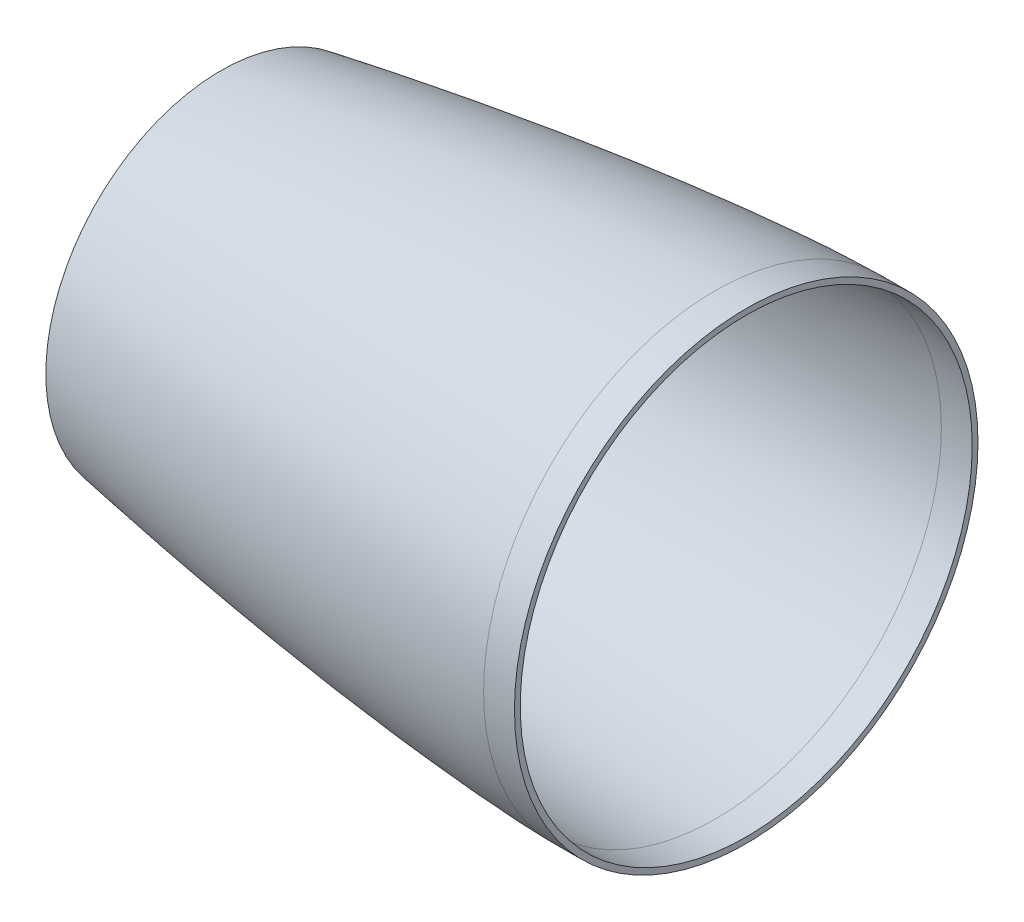
ISO-10303-21;
HEADER;
FILE_DESCRIPTION(('STEP AP214'),'2;1');
FILE_NAME('part.step','',(''),(''),'','','');
FILE_SCHEMA(('AUTOMOTIVE_DESIGN { 1 0 10303 214 1 1 1 1 }'));
ENDSEC;
DATA;
#1=APPLICATION_CONTEXT('core data for automotive mechanical design processes');
#2=APPLICATION_PROTOCOL_DEFINITION('international standard','automotive_design',2000,#1);
#3=PRODUCT_CONTEXT('',#1,'mechanical');
#4=PRODUCT('Part','Part','',(#3));
#5=PRODUCT_RELATED_PRODUCT_CATEGORY('part','',(#4));
#6=PRODUCT_DEFINITION_FORMATION('','',#4);
#7=PRODUCT_DEFINITION_CONTEXT('part definition',#1,'design');
#8=PRODUCT_DEFINITION('design','',#6,#7);
#9=PRODUCT_DEFINITION_SHAPE('','',#8);
#10=(LENGTH_UNIT() NAMED_UNIT(*) SI_UNIT(.MILLI.,.METRE.));
#11=(NAMED_UNIT(*) PLANE_ANGLE_UNIT() SI_UNIT($,.RADIAN.));
#12=(NAMED_UNIT(*) SI_UNIT($,.STERADIAN.) SOLID_ANGLE_UNIT());
#13=UNCERTAINTY_MEASURE_WITH_UNIT(LENGTH_MEASURE(1.E-05),#10,'distance_accuracy_value','');
#14=(GEOMETRIC_REPRESENTATION_CONTEXT(3) GLOBAL_UNCERTAINTY_ASSIGNED_CONTEXT((#13)) GLOBAL_UNIT_ASSIGNED_CONTEXT((#10,
#11,#12)) REPRESENTATION_CONTEXT('',''));
#15=CARTESIAN_POINT('',(0.,0.,0.));
#16=DIRECTION('',(0.,0.,1.));
#17=DIRECTION('',(1.,0.,0.));
#18=AXIS2_PLACEMENT_3D('',#15,#16,#17);
#19=CARTESIAN_POINT('',(457.2,95.2499999863099,0.));
#20=CARTESIAN_POINT('',(455.973700484007,95.2442558489218,0.));
#21=CARTESIAN_POINT('',(453.521410507465,95.2001609293709,0.));
#22=CARTESIAN_POINT('',(448.618051981354,95.0620461285506,0.));
#23=CARTESIAN_POINT('',(440.032338734873,94.6975648763611,0.));
#24=CARTESIAN_POINT('',(428.99507734638,94.0675681603095,0.));
#25=CARTESIAN_POINT('',(411.834102605625,92.8373554040269,0.));
#26=CARTESIAN_POINT('',(389.792768776019,90.8705573506526,0.));
#27=CARTESIAN_POINT('',(364.121565724609,88.1293712554599,0.));
#28=CARTESIAN_POINT('',(334.84304941187,84.4812168471433,0.));
#29=CARTESIAN_POINT('',(305.625866718072,80.3721875169129,0.));
#30=CARTESIAN_POINT('',(276.472706829773,75.8317963448619,0.));
#31=CARTESIAN_POINT('',(247.387631707993,70.8740216213803,0.));
#32=CARTESIAN_POINT('',(218.376688060461,65.4994445148525,0.));
#33=CARTESIAN_POINT('',(189.448153440764,59.6968671983802,0.));
#34=CARTESIAN_POINT('',(160.614305525022,53.4402971568738,0.));
#35=CARTESIAN_POINT('',(131.892371679484,46.686426531904,0.));
#36=CARTESIAN_POINT('',(103.310212009362,39.3619752554907,0.));
#37=CARTESIAN_POINT('',(75.6130579703372,31.5462124058929,0.));
#38=CARTESIAN_POINT('',(51.6882713202313,23.9818909923328,0.));
#39=CARTESIAN_POINT('',(32.6155540991965,17.1304800128776,0.));
#40=CARTESIAN_POINT('',(19.2936045724269,11.6017464036061,0.));
#41=CARTESIAN_POINT('',(11.4561201377879,7.87661771037368,0.));
#42=CARTESIAN_POINT('',(6.61398983203532,5.22529479758573,0.));
#43=CARTESIAN_POINT('',(3.82527199485086,3.46661844296927,0.));
#44=CARTESIAN_POINT('',(2.23811863344633,2.31922525620693,0.));
#45=CARTESIAN_POINT('',(1.3250808545305,1.56516933155385,0.));
#46=CARTESIAN_POINT('',(0.802086139992584,1.07329374189902,0.));
#47=CARTESIAN_POINT('',(0.508304998244186,0.760811711281794,0.));
#48=CARTESIAN_POINT('',(0.336037993223269,0.556544125855294,0.));
#49=CARTESIAN_POINT('',(0.220401302941073,0.406590083529717,0.));
#50=CARTESIAN_POINT('',(0.135390601814985,0.284235784515475,0.));
#51=CARTESIAN_POINT('',(0.0705930880732007,0.176725306763241,0.));
#52=CARTESIAN_POINT('',(0.0261974766976189,0.0850108023905772,0.));
#53=CARTESIAN_POINT('',(0.00822914946549372,0.0372713204893021,0.));
#54=CARTESIAN_POINT('',(0.0022614130657891,0.0125596339287031,0.));
#55=CARTESIAN_POINT('',(0.,0.,0.));
#56=B_SPLINE_CURVE_WITH_KNOTS('',4,(#19,#20,#21,#22,#23,#24,#25,#26,#27,#28,#29,#30,#31,#32,#33,
#34,#35,#36,#37,#38,#39,#40,#41,#42,#43,#44,#45,#46,#47,#48,#49,#50,#51,#52,#53,#54,#55),
.UNSPECIFIED.,.F.,.F.,(5,1,1,1,1,1,1,1,1,1,1,1,1,1,1,1,1,1,1,1,1,1,1,1,1,1,1,1,1,1,1,1,1,5),(0.,
0.010433363720785,0.0208667274415699,0.04173345488314,0.0731105437816442,0.104487632680148,
0.167241811319938,0.229995988937202,0.292750168797301,0.355504348198085,0.418258525795471,
0.481012702217603,0.543766882150059,0.606521057825231,0.669275237475743,0.7320294122646,
0.794783588320637,0.857537756842973,0.914093471826865,0.945470440384322,0.967145650741062,
0.980209293857501,0.987888433943443,0.992411964952562,0.995178478008313,0.996861315149704,
0.997956396193869,0.998516518943817,0.998825285148766,0.999134051353716,0.999567025676858,
0.999783512838429,0.999891756419214,1.),.UNSPECIFIED.);
#57=CARTESIAN_POINT('',(457.2,0.,0.));
#58=DIRECTION('',(1.,0.,0.));
#59=AXIS1_PLACEMENT('',#57,#58);
#60=SURFACE_OF_REVOLUTION('',#56,#59);
#61=CARTESIAN_POINT('',(254.,0.,0.));
#62=DIRECTION('',(1.,0.,0.));
#63=DIRECTION('',(0.,0.,-1.));
#64=AXIS2_PLACEMENT_3D('',#61,#62,#63);
#65=CIRCLE('',#64,71.9493683703437);
#66=CARTESIAN_POINT('',(254.,0.,-71.9493683703437));
#67=VERTEX_POINT('',#66);
#68=EDGE_CURVE('E111',#67,#67,#65,.F.);
#69=ORIENTED_EDGE('',*,*,#68,.F.);
#70=EDGE_LOOP('',(#69));
#71=FACE_BOUND('',#70,.T.);
#72=CARTESIAN_POINT('',(457.2,0.,0.));
#73=DIRECTION('',(1.,0.,0.));
#74=DIRECTION('',(0.,0.,-1.));
#75=AXIS2_PLACEMENT_3D('',#72,#73,#74);
#76=CIRCLE('',#75,95.2499999863099);
#77=CARTESIAN_POINT('',(457.2,0.,-95.2499999863099));
#78=VERTEX_POINT('',#77);
#79=EDGE_CURVE('E41',#78,#78,#76,.T.);
#80=ORIENTED_EDGE('',*,*,#79,.F.);
#81=EDGE_LOOP('',(#80));
#82=FACE_BOUND('',#81,.T.);
#83=ADVANCED_FACE('F33',(#71,#82),#60,.F.);
#84=CARTESIAN_POINT('',(469.9,0.,0.));
#85=DIRECTION('',(1.,0.,0.));
#86=DIRECTION('',(0.,0.,-1.));
#87=AXIS2_PLACEMENT_3D('',#84,#85,#86);
#88=PLANE('',#87);
#89=CARTESIAN_POINT('',(469.9,0.,0.));
#90=DIRECTION('',(1.,0.,0.));
#91=DIRECTION('',(0.,0.,-1.));
#92=AXIS2_PLACEMENT_3D('',#89,#90,#91);
#93=CIRCLE('',#92,92.8687499863099);
#94=CARTESIAN_POINT('',(469.9,0.,-92.8687499863099));
#95=VERTEX_POINT('',#94);
#96=EDGE_CURVE('E45',#95,#95,#93,.T.);
#97=ORIENTED_EDGE('',*,*,#96,.F.);
#98=EDGE_LOOP('',(#97));
#99=FACE_BOUND('',#98,.T.);
#100=CARTESIAN_POINT('',(469.9,0.,0.));
#101=DIRECTION('',(1.,0.,0.));
#102=DIRECTION('',(0.,0.,-1.));
#103=AXIS2_PLACEMENT_3D('',#100,#101,#102);
#104=CIRCLE('',#103,95.2499999863099);
#105=CARTESIAN_POINT('',(469.9,0.,-95.2499999863099));
#106=VERTEX_POINT('',#105);
#107=EDGE_CURVE('E10',#106,#106,#104,.T.);
#108=ORIENTED_EDGE('',*,*,#107,.T.);
#109=EDGE_LOOP('',(#108));
#110=FACE_BOUND('',#109,.T.);
#111=ADVANCED_FACE('F76',(#99,#110),#88,.T.);
#112=CARTESIAN_POINT('',(457.2,0.,0.));
#113=DIRECTION('',(1.,0.,0.));
#114=DIRECTION('',(0.,0.,-1.));
#115=AXIS2_PLACEMENT_3D('',#112,#113,#114);
#116=CYLINDRICAL_SURFACE('',#115,95.2499999863099);
#117=ORIENTED_EDGE('',*,*,#79,.T.);
#118=EDGE_LOOP('',(#117));
#119=FACE_BOUND('',#118,.T.);
#120=ORIENTED_EDGE('',*,*,#107,.F.);
#121=EDGE_LOOP('',(#120));
#122=FACE_BOUND('',#121,.T.);
#123=ADVANCED_FACE('F74',(#119,#122),#116,.T.);
#124=CARTESIAN_POINT('',(457.2,95.2499999863099,0.));
#125=CARTESIAN_POINT('',(455.973700484007,95.2442558489218,0.));
#126=CARTESIAN_POINT('',(453.521410507465,95.2001609293709,0.));
#127=CARTESIAN_POINT('',(448.618051981354,95.0620461285506,0.));
#128=CARTESIAN_POINT('',(440.032338734873,94.6975648763611,0.));
#129=CARTESIAN_POINT('',(428.99507734638,94.0675681603095,0.));
#130=CARTESIAN_POINT('',(411.834102605625,92.8373554040269,0.));
#131=CARTESIAN_POINT('',(389.792768776019,90.8705573506526,0.));
#132=CARTESIAN_POINT('',(364.121565724609,88.1293712554599,0.));
#133=CARTESIAN_POINT('',(334.84304941187,84.4812168471433,0.));
#134=CARTESIAN_POINT('',(305.625866718072,80.3721875169129,0.));
#135=CARTESIAN_POINT('',(276.472706829773,75.8317963448619,0.));
#136=CARTESIAN_POINT('',(247.387631707993,70.8740216213803,0.));
#137=CARTESIAN_POINT('',(218.376688060461,65.4994445148525,0.));
#138=CARTESIAN_POINT('',(189.448153440764,59.6968671983802,0.));
#139=CARTESIAN_POINT('',(160.614305525022,53.4402971568738,0.));
#140=CARTESIAN_POINT('',(131.892371679484,46.686426531904,0.));
#141=CARTESIAN_POINT('',(103.310212009362,39.3619752554907,0.));
#142=CARTESIAN_POINT('',(75.6130579703372,31.5462124058929,0.));
#143=CARTESIAN_POINT('',(51.6882713202313,23.9818909923328,0.));
#144=CARTESIAN_POINT('',(32.6155540991965,17.1304800128776,0.));
#145=CARTESIAN_POINT('',(19.2936045724269,11.6017464036061,0.));
#146=CARTESIAN_POINT('',(11.4561201377879,7.87661771037368,0.));
#147=CARTESIAN_POINT('',(6.61398983203532,5.22529479758573,0.));
#148=CARTESIAN_POINT('',(3.87367587993739,3.49714385756596,0.));
#149=CARTESIAN_POINT('',(2.49133298153212,2.502135096432,0.));
#150=CARTESIAN_POINT('',(1.86508041998311,2.00458915649318,0.));
#151=CARTESIAN_POINT('',(1.65873284612974,1.83361593097151,0.));
#152=B_SPLINE_CURVE_WITH_KNOTS('',4,(#124,#125,#126,#127,#128,#129,#130,#131,#132,#133,#134,
#135,#136,#137,#138,#139,#140,#141,#142,#143,#144,#145,#146,#147,#148,#149,#150,#151),
.UNSPECIFIED.,.F.,.F.,(5,1,1,1,1,1,1,1,1,1,1,1,1,1,1,1,1,1,1,1,1,1,1,1,5),(0.,0.010433363720785,
0.0208667274415699,0.04173345488314,0.0731105437816442,0.104487632680148,0.167241811319938,
0.229995988937202,0.292750168797301,0.355504348198085,0.418258525795471,0.481012702217603,
0.543766882150059,0.606521057825231,0.669275237475743,0.7320294122646,0.794783588320637,
0.857537756842973,0.914093471826865,0.945470440384322,0.967145650741062,0.980209293857501,
0.987888433943443,0.992411964952562,0.994691911123847),.UNSPECIFIED.);
#153=CARTESIAN_POINT('',(457.2,0.,0.));
#154=DIRECTION('',(1.,0.,0.));
#155=AXIS1_PLACEMENT('',#153,#154);
#156=SURFACE_OF_REVOLUTION('',#152,#155);
#157=OFFSET_SURFACE('',#156,2.38125,.F.);
#158=CARTESIAN_POINT('',(254.,0.,0.));
#159=DIRECTION('',(1.,0.,0.));
#160=DIRECTION('',(0.,0.,-1.));
#161=AXIS2_PLACEMENT_3D('',#158,#159,#160);
#162=CIRCLE('',#161,69.5320954741927);
#163=CARTESIAN_POINT('',(254.,0.,-69.5320954741927));
#164=VERTEX_POINT('',#163);
#165=EDGE_CURVE('E37',#164,#164,#162,.F.);
#166=ORIENTED_EDGE('',*,*,#165,.T.);
#167=EDGE_LOOP('',(#166));
#168=FACE_BOUND('',#167,.T.);
#169=CARTESIAN_POINT('',(457.211153944682,0.,-92.8687761093891));
#170=CARTESIAN_POINT('',(457.211153944693,1.51956333023553,-92.8688083430989));
#171=CARTESIAN_POINT('',(457.211153944686,3.03912391769829,-92.8314815992941));
#172=CARTESIAN_POINT('',(457.21115394467,6.07458580510599,-92.6823416034845));
#173=CARTESIAN_POINT('',(457.21115394466,7.59048710505097,-92.5705283514807));
#174=CARTESIAN_POINT('',(457.211153944673,10.614976615458,-92.2726467861058));
#175=CARTESIAN_POINT('',(457.211153944696,12.1235648259202,-92.0865784727363));
#176=CARTESIAN_POINT('',(457.211153944693,15.129794335426,-91.6406452004202));
#177=CARTESIAN_POINT('',(457.211153944666,16.6274356344696,-91.380780241474));
#178=CARTESIAN_POINT('',(457.211153944661,19.6081632383888,-90.7878769928279));
#179=CARTESIAN_POINT('',(457.211153944681,21.0912495432636,-90.4548387031248));
#180=CARTESIAN_POINT('',(457.211153944694,24.0392943097278,-89.7163918409233));
#181=CARTESIAN_POINT('',(457.211153944685,25.504252771318,-89.3109832684288));
#182=CARTESIAN_POINT('',(457.211153944691,28.4125126284623,-88.4287723099122));
#183=CARTESIAN_POINT('',(457.211153944705,29.855814024016,-87.9519699238893));
#184=CARTESIAN_POINT('',(457.211153944684,32.7172827122077,-86.9281200493908));
#185=CARTESIAN_POINT('',(457.211153944648,34.1354500048448,-86.3810725609129));
#186=CARTESIAN_POINT('',(457.211153944649,36.9432339972407,-85.218050352798));
#187=CARTESIAN_POINT('',(457.211153944685,38.3328506969994,-84.602075633161));
#188=CARTESIAN_POINT('',(457.211153944716,41.0801857954521,-83.3026829035522));
#189=CARTESIAN_POINT('',(457.211153944711,42.4379041941466,-82.6192648935816));
#190=CARTESIAN_POINT('',(457.211153944695,45.1181718278767,-81.1866319961491));
#191=CARTESIAN_POINT('',(457.211153944684,46.4407210629129,-80.4374171086884));
#192=CARTESIAN_POINT('',(457.211153944686,49.0474642324662,-78.874995380793));
#193=CARTESIAN_POINT('',(457.2111539447,50.3316581669818,-78.0617885403559));
#194=CARTESIAN_POINT('',(457.211153944694,52.8585969997471,-76.3733419929808));
#195=CARTESIAN_POINT('',(457.211153944675,54.1013418979975,-75.4981022860438));
#196=CARTESIAN_POINT('',(457.211153944667,56.5423887769597,-73.687698534781));
#197=CARTESIAN_POINT('',(457.211153944678,57.740690757671,-72.7525344904545));
#198=CARTESIAN_POINT('',(457.211153944686,60.0899649870447,-70.8245349565627));
#199=CARTESIAN_POINT('',(457.211153944682,61.2409372357096,-69.8316994670004));
#200=CARTESIAN_POINT('',(457.211153944671,63.4927792081553,-67.7907488701979));
#201=CARTESIAN_POINT('',(457.211153944663,64.5936489319335,-66.7426337629548));
#202=CARTESIAN_POINT('',(457.211153944664,66.7426337629274,-64.5936489319609));
#203=CARTESIAN_POINT('',(457.211153944673,67.7907488701444,-63.4927792082115));
#204=CARTESIAN_POINT('',(457.21115394468,69.8316994669796,-61.2409372357354));
#205=CARTESIAN_POINT('',(457.211153944678,70.824534956596,-60.0899649870071));
#206=CARTESIAN_POINT('',(457.211153944686,72.7525344905316,-57.7406907575742));
#207=CARTESIAN_POINT('',(457.211153944695,73.6876985348512,-56.5423887768698));
#208=CARTESIAN_POINT('',(457.211153944702,75.4981022861109,-54.1013418979027));
#209=CARTESIAN_POINT('',(457.211153944699,76.3733419930509,-52.8585969996397));
#210=CARTESIAN_POINT('',(457.211153944695,78.0617885404118,-50.3316581669008));
#211=CARTESIAN_POINT('',(457.211153944693,78.8749953808342,-49.0474642324259));
#212=CARTESIAN_POINT('',(457.211153944696,80.4374171086719,-46.4407210629122));
#213=CARTESIAN_POINT('',(457.211153944701,81.1866319960876,-45.1181718278738));
#214=CARTESIAN_POINT('',(457.211153944705,82.6192648936488,-42.4379041941388));
#215=CARTESIAN_POINT('',(457.211153944704,83.3026829037927,-41.0801857954413));
#216=CARTESIAN_POINT('',(457.211153944683,84.6020756329367,-38.3328506969757));
#217=CARTESIAN_POINT('',(457.211153944661,85.2180503519373,-36.9432339972076));
#218=CARTESIAN_POINT('',(457.211153944649,86.3810725617368,-34.1354500049671));
#219=CARTESIAN_POINT('',(457.211153944658,86.9281200525372,-32.7172827124952));
#220=CARTESIAN_POINT('',(457.211153944665,87.9519699206508,-29.855814023985));
#221=CARTESIAN_POINT('',(457.211153944663,88.4287722979612,-28.4125126279457));
#222=CARTESIAN_POINT('',(457.211153944652,89.3109832803722,-25.5042527718585));
#223=CARTESIAN_POINT('',(457.211153944643,89.7163918854738,-24.0392943118108));
#224=CARTESIAN_POINT('',(457.211153944668,90.4548386586132,-21.0912495410246));
#225=CARTESIAN_POINT('',(457.211153944702,90.7878768266554,-19.6081632302871));
#226=CARTESIAN_POINT('',(457.211153944698,91.3807804076115,-16.6274356427487));
#227=CARTESIAN_POINT('',(457.21115394466,91.6406458205201,-15.1297943659467));
#228=CARTESIAN_POINT('',(457.211153944659,92.0865778526448,-12.1235647953402));
#229=CARTESIAN_POINT('',(457.211153944695,92.272644471858,-10.6149765015354));
#230=CARTESIAN_POINT('',(457.211153944709,92.5705306657742,-7.59048721851447));
#231=CARTESIAN_POINT('',(457.211153944685,92.6823502404868,-6.07458622929927));
#232=CARTESIAN_POINT('',(457.211153944671,92.8314729622975,-3.03912349338961));
#233=CARTESIAN_POINT('',(457.211153944679,92.8687761093891,-1.51956174669482));
#234=CARTESIAN_POINT('',(457.211153944685,92.8687761093891,1.51956174669473));
#235=CARTESIAN_POINT('',(457.211153944682,92.8314729622975,3.0391234933895));
#236=CARTESIAN_POINT('',(457.211153944674,92.682350240481,6.07458622941406));
#237=CARTESIAN_POINT('',(457.21115394467,92.5705306657571,7.59048721874389));
#238=CARTESIAN_POINT('',(457.211153944664,92.2726444718297,10.6149765017638));
#239=CARTESIAN_POINT('',(457.211153944661,92.0865778526279,12.123564795454));
#240=CARTESIAN_POINT('',(457.211153944659,91.6406458205368,15.1297943658344));
#241=CARTESIAN_POINT('',(457.211153944659,91.3807804076502,16.627435642525));
#242=CARTESIAN_POINT('',(457.211153944672,90.7878768266933,19.6081632301241));
#243=CARTESIAN_POINT('',(457.211153944686,90.4548386586146,21.091249541031));
#244=CARTESIAN_POINT('',(457.211153944694,89.7163918854556,24.0392943118722));
#245=CARTESIAN_POINT('',(457.211153944688,89.3109832803846,25.5042527718089));
#246=CARTESIAN_POINT('',(457.211153944689,88.4287722979961,28.4125126278406));
#247=CARTESIAN_POINT('',(457.211153944695,87.9519699206696,29.8558140239329));
#248=CARTESIAN_POINT('',(457.211153944694,86.9281200525554,32.7172827124449));
#249=CARTESIAN_POINT('',(457.211153944687,86.3810725617755,34.1354500048674));
#250=CARTESIAN_POINT('',(457.211153944688,85.218050351976,36.9432339971212));
#251=CARTESIAN_POINT('',(457.211153944697,84.6020756329497,38.3328506969498));
#252=CARTESIAN_POINT('',(457.211153944705,83.3026829038035,41.0801857954171));
#253=CARTESIAN_POINT('',(457.211153944706,82.619264893689,42.4379041940583));
#254=CARTESIAN_POINT('',(457.2111539447,81.1866319961379,45.1181718277848));
#255=CARTESIAN_POINT('',(457.211153944693,80.4374171086982,46.4407210628683));
#256=CARTESIAN_POINT('',(457.211153944677,78.8749953808012,49.0474642324808));
#257=CARTESIAN_POINT('',(457.211153944667,78.061788540343,50.3316581670091));
#258=CARTESIAN_POINT('',(457.211153944668,76.3733419929674,52.8585969997588));
#259=CARTESIAN_POINT('',(457.211153944679,75.4981022860529,54.1013418979821));
#260=CARTESIAN_POINT('',(457.211153944683,73.6876985348192,56.5423887769115));
#261=CARTESIAN_POINT('',(457.211153944676,72.7525344904982,57.7406907576162));
#262=CARTESIAN_POINT('',(457.211153944688,70.824534956624,60.0899649869716));
#263=CARTESIAN_POINT('',(457.211153944706,69.8316994670742,61.2409372356252));
#264=CARTESIAN_POINT('',(457.211153944698,67.7907488702572,63.4927792080932));
#265=CARTESIAN_POINT('',(457.211153944671,66.7426337629852,64.5936489319032));
#266=CARTESIAN_POINT('',(457.211153944655,64.5936489319637,66.7426337629246));
#267=CARTESIAN_POINT('',(457.211153944666,63.4927792082173,67.7907488701389));
#268=CARTESIAN_POINT('',(457.211153944686,61.2409372356947,69.8316994670167));
#269=CARTESIAN_POINT('',(457.211153944695,60.0899649869147,70.824534956676));
#270=CARTESIAN_POINT('',(457.211153944691,57.7406907574879,72.7525344905984));
#271=CARTESIAN_POINT('',(457.211153944677,56.5423887768462,73.6876985348676));
#272=CARTESIAN_POINT('',(457.211153944685,54.1013418979307,75.4981022860911));
#273=CARTESIAN_POINT('',(457.211153944707,52.858596999654,76.3733419930414));
#274=CARTESIAN_POINT('',(457.211153944707,50.3316581669009,78.0617885404118));
#275=CARTESIAN_POINT('',(457.211153944686,49.0474642324259,78.8749953808341));
#276=CARTESIAN_POINT('',(457.211153944685,46.4407210629123,80.4374171086718));
#277=CARTESIAN_POINT('',(457.211153944705,45.1181718278738,81.1866319960876));
#278=CARTESIAN_POINT('',(457.211153944717,42.4379041941497,82.6192648936431));
#279=CARTESIAN_POINT('',(457.211153944709,41.0801857954634,83.3026829037816));
#280=CARTESIAN_POINT('',(457.211153944678,38.3328506969983,84.6020756329267));
#281=CARTESIAN_POINT('',(457.211153944656,36.943233997219,85.2180503519325));
#282=CARTESIAN_POINT('',(457.211153944642,34.1354500049671,86.3810725617368));
#283=CARTESIAN_POINT('',(457.211153944651,32.7172827124952,86.9281200525372));
#284=CARTESIAN_POINT('',(457.211153944672,29.8558140240293,87.951969920635));
#285=CARTESIAN_POINT('',(457.211153944686,28.412512628035,88.4287722979318));
#286=CARTESIAN_POINT('',(457.211153944691,25.5042527719526,89.3109832803463));
#287=CARTESIAN_POINT('',(457.211153944684,24.0392943118634,89.7163918854606));
#288=CARTESIAN_POINT('',(457.211153944691,21.0912495410317,90.4548386586117));
#289=CARTESIAN_POINT('',(457.211153944706,19.6081632302907,90.7878768266547));
#290=CARTESIAN_POINT('',(457.21115394469,16.6274356426947,91.3807804076222));
#291=CARTESIAN_POINT('',(457.211153944658,15.1297943658382,91.6406458205389));
#292=CARTESIAN_POINT('',(457.211153944661,12.1235647953448,92.0865778526414));
#293=CARTESIAN_POINT('',(457.211153944696,10.6149765017091,92.2726444718352));
#294=CARTESIAN_POINT('',(457.211153944708,7.59048721868678,92.5705306657629));
#295=CARTESIAN_POINT('',(457.211153944684,6.07458622929939,92.6823502404896));
#296=CARTESIAN_POINT('',(457.211153944672,3.03912349327448,92.8314729623003));
#297=CARTESIAN_POINT('',(457.211153944682,1.51956174663719,92.8687761093891));
#298=CARTESIAN_POINT('',(457.211153944682,-1.51956174669482,92.8687761093891));
#299=CARTESIAN_POINT('',(457.211153944672,-3.03912349338955,92.8314729622975));
#300=CARTESIAN_POINT('',(457.211153944684,-6.07458622935665,92.6823502404839));
#301=CARTESIAN_POINT('',(457.211153944705,-7.59048721862919,92.5705306657657));
#302=CARTESIAN_POINT('',(457.211153944698,-10.6149765016517,92.2726444718437));
#303=CARTESIAN_POINT('',(457.21115394467,-12.1235647954013,92.0865778526359));
#304=CARTESIAN_POINT('',(457.211153944648,-15.1297943658947,91.6406458205276));
#305=CARTESIAN_POINT('',(457.211153944655,-16.6274356426389,91.3807804076303));
#306=CARTESIAN_POINT('',(457.211153944672,-19.6081632302314,90.7878768266692));
#307=CARTESIAN_POINT('',(457.211153944683,-21.091249541079,90.4548386586024));
#308=CARTESIAN_POINT('',(457.211153944696,-24.0392943119107,89.7163918854462));
#309=CARTESIAN_POINT('',(457.211153944697,-25.5042527718958,89.3109832803607));
#310=CARTESIAN_POINT('',(457.21115394468,-28.4125126279296,88.4287722979666));
#311=CARTESIAN_POINT('',(457.211153944661,-29.855814023977,87.9519699206537));
#312=CARTESIAN_POINT('',(457.211153944662,-32.7172827125349,86.928120052523));
#313=CARTESIAN_POINT('',(457.21115394468,-34.135450005046,86.3810725617065));
#314=CARTESIAN_POINT('',(457.211153944695,-36.9432339972964,85.2180503518984));
#315=CARTESIAN_POINT('',(457.211153944691,-38.3328506970364,84.6020756329087));
#316=CARTESIAN_POINT('',(457.211153944695,-41.0801857954172,83.3026829038034));
#317=CARTESIAN_POINT('',(457.211153944703,-42.4379041940584,82.619264893689));
#318=CARTESIAN_POINT('',(457.211153944702,-45.118171827798,81.1866319961309));
#319=CARTESIAN_POINT('',(457.211153944694,-46.4407210628943,80.4374171086835));
#320=CARTESIAN_POINT('',(457.211153944677,-49.0474642324784,78.8749953808018));
#321=CARTESIAN_POINT('',(457.211153944668,-50.3316581669672,78.0617885403692));
#322=CARTESIAN_POINT('',(457.211153944667,-52.8585969997592,76.373341992969));
#323=CARTESIAN_POINT('',(457.211153944674,-54.1013418980606,75.4981022859986));
#324=CARTESIAN_POINT('',(457.211153944688,-56.5423887769825,73.6876985347626));
#325=CARTESIAN_POINT('',(457.211153944696,-57.7406907576076,72.752534490503));
#326=CARTESIAN_POINT('',(457.21115394469,-60.0899649869823,70.8245349566176));
#327=CARTESIAN_POINT('',(457.211153944677,-61.2409372357278,69.8316994669867));
#328=CARTESIAN_POINT('',(457.211153944676,-63.4927792082173,67.7907488701389));
#329=CARTESIAN_POINT('',(457.211153944688,-64.5936489319638,66.7426337629247));
#330=CARTESIAN_POINT('',(457.211153944688,-66.7426337629246,64.5936489319639));
#331=CARTESIAN_POINT('',(457.211153944675,-67.7907488701389,63.4927792082174));
#332=CARTESIAN_POINT('',(457.211153944678,-69.8316994669867,61.2409372357278));
#333=CARTESIAN_POINT('',(457.211153944693,-70.8245349566176,60.0899649869824));
#334=CARTESIAN_POINT('',(457.211153944693,-72.7525344905434,57.7406907575585));
#335=CARTESIAN_POINT('',(457.211153944678,-73.6876985348409,56.5423887768822));
#336=CARTESIAN_POINT('',(457.211153944684,-75.4981022860814,54.1013418979437));
#337=CARTESIAN_POINT('',(457.211153944704,-76.3733419930228,52.8585969996803));
#338=CARTESIAN_POINT('',(457.21115394471,-78.0617885403946,50.3316581669281));
#339=CARTESIAN_POINT('',(457.211153944696,-78.8749953808259,49.0474642324397));
#340=CARTESIAN_POINT('',(457.211153944674,-80.437417108698,46.4407210628685));
#341=CARTESIAN_POINT('',(457.211153944667,-81.1866319961377,45.1181718277849));
#342=CARTESIAN_POINT('',(457.211153944677,-82.6192648937135,42.4379041940123));
#343=CARTESIAN_POINT('',(457.211153944695,-83.3026829038504,41.0801857953238));
#344=CARTESIAN_POINT('',(457.211153944707,-84.6020756329511,38.332850696941));
#345=CARTESIAN_POINT('',(457.2111539447,-85.2180503519184,36.9432339972482));
#346=CARTESIAN_POINT('',(457.211153944676,-86.3810725617065,34.1354500050461));
#347=CARTESIAN_POINT('',(457.211153944658,-86.9281200525229,32.717282712535));
#348=CARTESIAN_POINT('',(457.211153944665,-87.9519699206322,29.8558140240371));
#349=CARTESIAN_POINT('',(457.211153944691,-88.4287722979266,28.4125126280509));
#350=CARTESIAN_POINT('',(457.211153944686,-89.3109832803418,25.5042527719686));
#351=CARTESIAN_POINT('',(457.211153944655,-89.7163918854585,24.0392943118714));
#352=CARTESIAN_POINT('',(457.211153944656,-90.454838658626,21.0912495409738));
#353=CARTESIAN_POINT('',(457.211153944688,-90.7878768266807,19.6081632301744));
#354=CARTESIAN_POINT('',(457.211153944708,-91.3807804076431,16.6274356425753));
#355=CARTESIAN_POINT('',(457.211153944695,-91.6406458205486,15.1297943657751));
#356=CARTESIAN_POINT('',(457.211153944693,-92.0865778526589,12.1235647952267));
#357=CARTESIAN_POINT('',(457.211153944704,-92.2726444718636,10.6149765014785));
#358=CARTESIAN_POINT('',(457.211153944699,-92.5705306657741,7.59048721851448));
#359=CARTESIAN_POINT('',(457.211153944683,-92.6823502404867,6.07458622929928));
#360=CARTESIAN_POINT('',(457.211153944673,-92.8314729622975,3.03912349338967));
#361=CARTESIAN_POINT('',(457.211153944679,-92.8687761093891,1.51956174669495));
#362=CARTESIAN_POINT('',(457.211153944685,-92.8687761093891,-1.51956174669466));
#363=CARTESIAN_POINT('',(457.211153944684,-92.8314729622975,-3.03912349338955));
#364=CARTESIAN_POINT('',(457.211153944672,-92.6823502404811,-6.07458622941345));
#365=CARTESIAN_POINT('',(457.211153944661,-92.5705306657571,-7.59048721874252));
#366=CARTESIAN_POINT('',(457.211153944673,-92.2726444718299,-10.6149765017624));
#367=CARTESIAN_POINT('',(457.211153944696,-92.0865778526282,-12.1235647954534));
#368=CARTESIAN_POINT('',(457.211153944694,-91.6406458205281,-15.1297943658934));
#369=CARTESIAN_POINT('',(457.211153944669,-91.3807804076298,-16.6274356426424));
#370=CARTESIAN_POINT('',(457.211153944662,-90.7878768266782,-19.6081632301853));
#371=CARTESIAN_POINT('',(457.211153944681,-90.4548386586248,-21.0912495409792));
#372=CARTESIAN_POINT('',(457.211153944699,-89.7163918854735,-24.0392943118124));
#373=CARTESIAN_POINT('',(457.211153944698,-89.3109832803744,-25.5042527718513));
#374=CARTESIAN_POINT('',(457.211153944679,-88.4287722979611,-28.4125126279472));
#375=CARTESIAN_POINT('',(457.211153944659,-87.9519699206449,-29.8558140240035));
#376=CARTESIAN_POINT('',(457.211153944664,-86.9281200525262,-32.7172827125241));
#377=CARTESIAN_POINT('',(457.211153944688,-86.3810725617279,-34.1354500049898));
#378=CARTESIAN_POINT('',(457.211153944688,-85.2180503519198,-36.9432339972494));
#379=CARTESIAN_POINT('',(457.211153944665,-84.602075632907,-38.3328506970421));
#380=CARTESIAN_POINT('',(457.211153944658,-83.3026829037678,-41.0801857954897));
#381=CARTESIAN_POINT('',(457.211153944675,-82.6192648936441,-42.4379041941461));
#382=CARTESIAN_POINT('',(457.211153944685,-81.186631996079,-45.118171827891));
#383=CARTESIAN_POINT('',(457.211153944679,-80.4374171086349,-46.4407210629781));
#384=CARTESIAN_POINT('',(457.211153944692,-78.8749953807699,-49.0474642325289));
#385=CARTESIAN_POINT('',(457.211153944711,-78.0617885403515,-50.3316581669941));
#386=CARTESIAN_POINT('',(457.211153944702,-76.3733419929908,-52.8585969997267));
#387=CARTESIAN_POINT('',(457.211153944674,-75.4981022860464,-54.1013418979927));
#388=CARTESIAN_POINT('',(457.211153944667,-73.6876985347988,-56.5423887769372));
#389=CARTESIAN_POINT('',(457.21115394469,-72.7525344904971,-57.7406907576168));
#390=CARTESIAN_POINT('',(457.211153944696,-70.8245349565769,-60.0899649870298));
#391=CARTESIAN_POINT('',(457.211153944681,-69.8316994669566,-61.2409372357617));
#392=CARTESIAN_POINT('',(457.211153944672,-67.7907488701534,-63.4927792082007));
#393=CARTESIAN_POINT('',(457.211153944678,-66.7426337629744,-64.5936489319113));
#394=CARTESIAN_POINT('',(457.211153944698,-64.5936489320299,-66.7426337628615));
#395=CARTESIAN_POINT('',(457.211153944711,-63.4927792082615,-67.7907488700984));
#396=CARTESIAN_POINT('',(457.211153944694,-61.2409372357619,-69.8316994669566));
#397=CARTESIAN_POINT('',(457.211153944664,-60.0899649870298,-70.8245349565771));
#398=CARTESIAN_POINT('',(457.211153944646,-57.7406907576167,-72.7525344904966));
#399=CARTESIAN_POINT('',(457.211153944658,-56.5423887769372,-73.6876985347974));
#400=CARTESIAN_POINT('',(457.211153944683,-54.10134189798,-75.4981022860571));
#401=CARTESIAN_POINT('',(457.211153944695,-52.8585969997007,-76.3733419930136));
#402=CARTESIAN_POINT('',(457.211153944698,-50.3316581669544,-78.0617885403724));
#403=CARTESIAN_POINT('',(457.211153944689,-49.0474642324893,-78.8749953807775));
#404=CARTESIAN_POINT('',(457.211153944681,-46.4407210629971,-80.4374171086396));
#405=CARTESIAN_POINT('',(457.211153944684,-45.1181718279701,-81.1866319960969));
#406=CARTESIAN_POINT('',(457.211153944677,-42.4379041941886,-82.6192648935611));
#407=CARTESIAN_POINT('',(457.211153944668,-41.0801857954315,-83.3026829035633));
#408=CARTESIAN_POINT('',(457.211153944671,-38.332850696958,-84.6020756331788));
#409=CARTESIAN_POINT('',(457.211153944682,-36.9432339972434,-85.2180503527962));
#410=CARTESIAN_POINT('',(457.211153944694,-34.1354500049479,-86.3810725608714));
#411=CARTESIAN_POINT('',(457.211153944693,-32.7172827123671,-86.9281200493298));
#412=CARTESIAN_POINT('',(457.211153944696,-29.8558140242167,-87.9519699238215));
#413=CARTESIAN_POINT('',(457.211153944699,-28.4125126286465,-88.4287723098534));
#414=CARTESIAN_POINT('',(457.211153944678,-25.5042527714311,-89.3109832683974));
#415=CARTESIAN_POINT('',(457.211153944653,-24.0392943097855,-89.7163918409086));
#416=CARTESIAN_POINT('',(457.211153944658,-21.0912495432552,-90.4548387031269));
#417=CARTESIAN_POINT('',(457.211153944689,-19.60816323837,-90.7878769928323));
#418=CARTESIAN_POINT('',(457.211153944707,-16.6274356344263,-91.3807802414823));
#419=CARTESIAN_POINT('',(457.211153944696,-15.1297943353686,-91.6406452004299));
#420=CARTESIAN_POINT('',(457.211153944694,-12.1235648258945,-92.0865784727389));
#421=CARTESIAN_POINT('',(457.211153944704,-10.6149766154786,-92.2726467861028));
#422=CARTESIAN_POINT('',(457.2111539447,-7.59048710504933,-92.5705283514822));
#423=CARTESIAN_POINT('',(457.211153944687,-6.0745858050353,-92.6823416034904));
#424=CARTESIAN_POINT('',(457.211153944669,-3.03912391760502,-92.8314815992963));
#425=CARTESIAN_POINT('',(457.211153944665,-1.519563330189,-92.8688083430987));
#426=CARTESIAN_POINT('',(457.211153944682,-2.33354173109666E-13,-92.8687761093891));
#427=B_SPLINE_CURVE_WITH_KNOTS('',3,(#169,#170,#171,#172,#173,#174,#175,#176,#177,#178,#179,
#180,#181,#182,#183,#184,#185,#186,#187,#188,#189,#190,#191,#192,#193,#194,#195,#196,#197,#198,
#199,#200,#201,#202,#203,#204,#205,#206,#207,#208,#209,#210,#211,#212,#213,#214,#215,#216,#217,
#218,#219,#220,#221,#222,#223,#224,#225,#226,#227,#228,#229,#230,#231,#232,#233,#234,#235,#236,
#237,#238,#239,#240,#241,#242,#243,#244,#245,#246,#247,#248,#249,#250,#251,#252,#253,#254,#255,
#256,#257,#258,#259,#260,#261,#262,#263,#264,#265,#266,#267,#268,#269,#270,#271,#272,#273,#274,
#275,#276,#277,#278,#279,#280,#281,#282,#283,#284,#285,#286,#287,#288,#289,#290,#291,#292,#293,
#294,#295,#296,#297,#298,#299,#300,#301,#302,#303,#304,#305,#306,#307,#308,#309,#310,#311,#312,
#313,#314,#315,#316,#317,#318,#319,#320,#321,#322,#323,#324,#325,#326,#327,#328,#329,#330,#331,
#332,#333,#334,#335,#336,#337,#338,#339,#340,#341,#342,#343,#344,#345,#346,#347,#348,#349,#350,
#351,#352,#353,#354,#355,#356,#357,#358,#359,#360,#361,#362,#363,#364,#365,#366,#367,#368,#369,
#370,#371,#372,#373,#374,#375,#376,#377,#378,#379,#380,#381,#382,#383,#384,#385,#386,#387,#388,
#389,#390,#391,#392,#393,#394,#395,#396,#397,#398,#399,#400,#401,#402,#403,#404,#405,#406,#407,
#408,#409,#410,#411,#412,#413,#414,#415,#416,#417,#418,#419,#420,#421,#422,#423,#424,#425,#426),
.UNSPECIFIED.,.F.,.F.,(4,2,2,2,2,2,2,2,2,2,2,2,2,2,2,2,2,2,2,2,2,2,2,2,2,2,2,2,2,2,2,2,2,2,2,2,
2,2,2,2,2,2,2,2,2,2,2,2,2,2,2,2,2,2,2,2,2,2,2,2,2,2,2,2,2,2,2,2,2,2,2,2,2,2,2,2,2,2,2,2,2,2,2,2,
2,2,2,2,2,2,2,2,2,2,2,2,2,2,2,2,2,2,2,2,2,2,2,2,2,2,2,2,2,2,2,2,2,2,2,2,2,2,2,2,2,2,2,2,4),(0.,
4.55822771437801,9.11645542869741,13.6746831429198,18.2329108571218,22.7911385715196,
27.3493662856714,31.9075939998854,36.4658217142518,41.0240494286218,45.5822771429125,
50.1405048571175,54.6987325714925,59.2569602857913,63.8151880001474,68.3734157142585,
72.9316434285983,77.4898711428217,82.0480988571829,86.6063265715082,91.1645542858481,
95.7227820000789,100.281009714284,104.839237428612,109.397465142911,113.955692857118,
118.513920571512,123.072148285845,127.630375999896,132.18860371428,136.746831428844,
141.305059142819,145.863286857196,150.421514571574,154.979742285894,159.537970000113,
164.096197714156,168.654425428726,173.212653142715,177.770880857274,182.329108571321,
186.887336285818,191.445563999956,196.003791714314,200.562019428737,205.120247142936,
209.678474857265,214.236702571326,218.794930285795,223.353158000006,227.911385714568,
232.469613428653,237.027841143045,241.586068857275,246.14429657148,250.702524285771,
255.260752000108,259.818979714315,264.377207428568,268.935435143031,273.493662857093,
278.051890571641,282.610118285695,287.168346000188,291.726573714393,296.28480142877,
300.843029142918,305.401256857316,309.959484571523,314.517712285912,319.075940000052,
323.634167714471,328.192395428805,332.750623143015,337.308850857152,341.867078571555,
346.425306285837,350.983534000324,355.541761714351,360.09998942878,364.658217142991,
369.216444857203,373.774672571631,378.33290028585,382.891128000193,387.449355714472,
392.00758342883,396.565811143124,401.124038857177,405.682266571511,410.240494285739,
414.798722000227,419.356949714468,423.915177428844,428.473405143237,433.031632857212,
437.589860571589,442.148088285967,446.706316000285,451.264543714506,455.822771428728,
460.380999142951,464.939226857257,469.497454571705,474.055682285892,478.613910000274,
483.172137714465,487.730365428839,492.288593143038,496.846820857394,501.405048571628,
505.963276286005,510.521504000065,515.079731714371,519.637959428748,524.196187142982,
528.754414857385,533.312642571581,537.870870285757,542.429098000258,546.987325714483,
551.545553428671,556.10378114294,560.662008857264,565.220236571694,569.778464285939,
574.336692000021,578.894919714548,583.453147428786),.UNSPECIFIED.);
#428=CARTESIAN_POINT('',(457.211153944682,0.,-92.8687761093891));
#429=VERTEX_POINT('',#428);
#430=EDGE_CURVE('E56',#429,#429,#427,.T.);
#431=ORIENTED_EDGE('',*,*,#430,.T.);
#432=EDGE_LOOP('',(#431));
#433=FACE_BOUND('',#432,.T.);
#434=ADVANCED_FACE('F71',(#168,#433),#157,.T.);
#435=CARTESIAN_POINT('',(457.2,0.,0.));
#436=DIRECTION('',(1.,0.,0.));
#437=DIRECTION('',(0.,0.,-1.));
#438=AXIS2_PLACEMENT_3D('',#435,#436,#437);
#439=CYLINDRICAL_SURFACE('',#438,92.8687499863099);
#440=ORIENTED_EDGE('',*,*,#430,.F.);
#441=EDGE_LOOP('',(#440));
#442=FACE_BOUND('',#441,.T.);
#443=ORIENTED_EDGE('',*,*,#96,.T.);
#444=EDGE_LOOP('',(#443));
#445=FACE_BOUND('',#444,.T.);
#446=ADVANCED_FACE('F86',(#442,#445),#439,.F.);
#447=CARTESIAN_POINT('',(254.,0.,0.));
#448=DIRECTION('',(1.,0.,0.));
#449=DIRECTION('',(0.,0.,-1.));
#450=AXIS2_PLACEMENT_3D('',#447,#448,#449);
#451=PLANE('',#450);
#452=ORIENTED_EDGE('',*,*,#68,.T.);
#453=EDGE_LOOP('',(#452));
#454=FACE_BOUND('',#453,.T.);
#455=ORIENTED_EDGE('',*,*,#165,.F.);
#456=EDGE_LOOP('',(#455));
#457=FACE_BOUND('',#456,.T.);
#458=ADVANCED_FACE('F88',(#454,#457),#451,.F.);
#459=CLOSED_SHELL('',(#83,#111,#123,#434,#446,#458));
#460=MANIFOLD_SOLID_BREP('B2',#459);
#461=ADVANCED_BREP_SHAPE_REPRESENTATION('',(#18,#460),#14);
#462=SHAPE_DEFINITION_REPRESENTATION(#9,#461);
ENDSEC;
END-ISO-10303-21;
